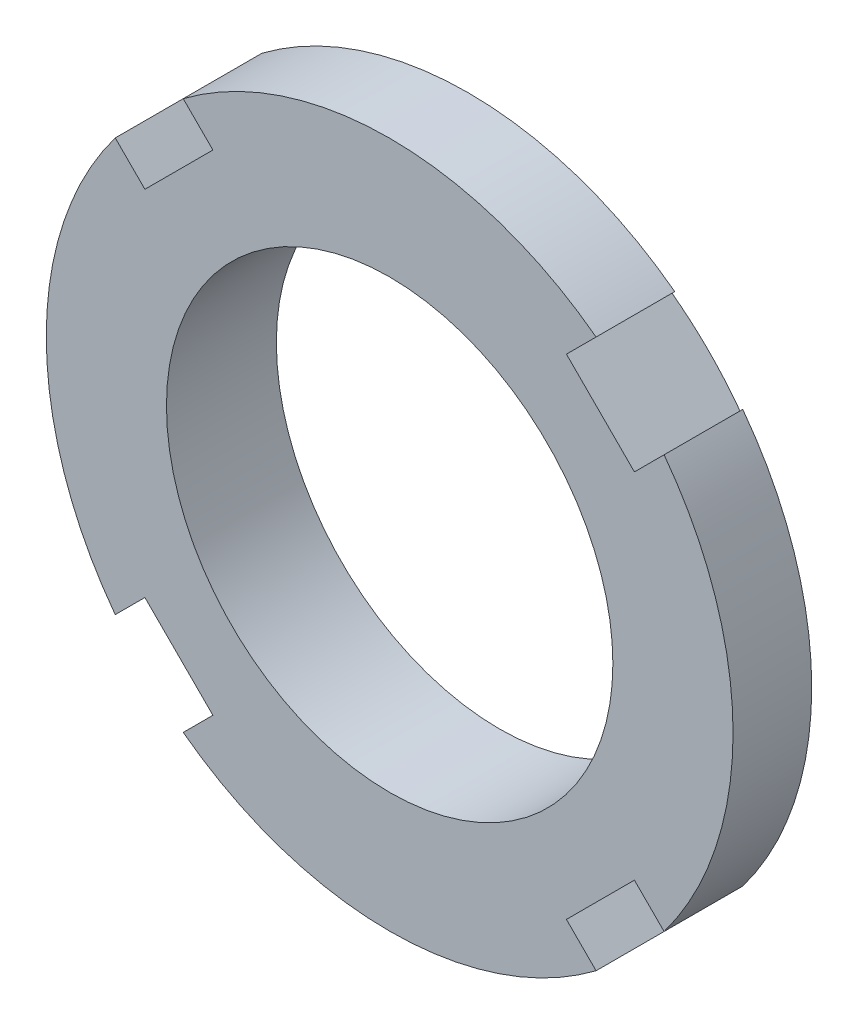
ISO-10303-21;
HEADER;
FILE_DESCRIPTION(('STEP AP214'),'2;1');
FILE_NAME('part.step','',(''),(''),'','','');
FILE_SCHEMA(('AUTOMOTIVE_DESIGN { 1 0 10303 214 1 1 1 1 }'));
ENDSEC;
DATA;
#1=APPLICATION_CONTEXT('core data for automotive mechanical design processes');
#2=APPLICATION_PROTOCOL_DEFINITION('international standard','automotive_design',2000,#1);
#3=PRODUCT_CONTEXT('',#1,'mechanical');
#4=PRODUCT('Part','Part','',(#3));
#5=PRODUCT_RELATED_PRODUCT_CATEGORY('part','',(#4));
#6=PRODUCT_DEFINITION_FORMATION('','',#4);
#7=PRODUCT_DEFINITION_CONTEXT('part definition',#1,'design');
#8=PRODUCT_DEFINITION('design','',#6,#7);
#9=PRODUCT_DEFINITION_SHAPE('','',#8);
#10=(LENGTH_UNIT() NAMED_UNIT(*) SI_UNIT(.MILLI.,.METRE.));
#11=(NAMED_UNIT(*) PLANE_ANGLE_UNIT() SI_UNIT($,.RADIAN.));
#12=(NAMED_UNIT(*) SI_UNIT($,.STERADIAN.) SOLID_ANGLE_UNIT());
#13=UNCERTAINTY_MEASURE_WITH_UNIT(LENGTH_MEASURE(1.E-05),#10,'distance_accuracy_value','');
#14=(GEOMETRIC_REPRESENTATION_CONTEXT(3) GLOBAL_UNCERTAINTY_ASSIGNED_CONTEXT((#13)) GLOBAL_UNIT_ASSIGNED_CONTEXT((#10,
#11,#12)) REPRESENTATION_CONTEXT('',''));
#15=CARTESIAN_POINT('',(0.,0.,0.));
#16=DIRECTION('',(0.,0.,1.));
#17=DIRECTION('',(1.,0.,0.));
#18=AXIS2_PLACEMENT_3D('',#15,#16,#17);
#19=CARTESIAN_POINT('',(0.,0.,8.));
#20=DIRECTION('',(0.,0.,-1.));
#21=DIRECTION('',(-1.,0.,0.));
#22=AXIS2_PLACEMENT_3D('',#19,#20,#21);
#23=CYLINDRICAL_SURFACE('',#22,25.);
#24=DIRECTION('',(0.,0.,1.));
#25=VECTOR('',#24,1.);
#26=CARTESIAN_POINT('',(-19.9784447983671,15.0286973300616,0.));
#27=LINE('',#26,#25);
#28=CARTESIAN_POINT('',(-19.9784447983671,15.0286973300616,2.27292657619126));
#29=VERTEX_POINT('',#28);
#30=CARTESIAN_POINT('',(-19.9784447983671,15.0286973300616,8.));
#31=VERTEX_POINT('',#30);
#32=EDGE_CURVE('E255',#29,#31,#27,.T.);
#33=ORIENTED_EDGE('',*,*,#32,.F.);
#34=CARTESIAN_POINT('',(0.,0.,2.27292657619126));
#35=DIRECTION('',(0.,0.,1.));
#36=DIRECTION('',(1.,0.,0.));
#37=AXIS2_PLACEMENT_3D('',#34,#35,#36);
#38=CIRCLE('',#37,25.);
#39=CARTESIAN_POINT('',(-19.9784447983673,-15.0286973300613,2.27292657619126));
#40=VERTEX_POINT('',#39);
#41=EDGE_CURVE('E250',#29,#40,#38,.T.);
#42=ORIENTED_EDGE('',*,*,#41,.T.);
#43=DIRECTION('',(0.,0.,1.));
#44=VECTOR('',#43,1.);
#45=CARTESIAN_POINT('',(-19.9784447983673,-15.0286973300613,0.));
#46=LINE('',#45,#44);
#47=CARTESIAN_POINT('',(-19.9784447983673,-15.0286973300613,8.));
#48=VERTEX_POINT('',#47);
#49=EDGE_CURVE('E275',#40,#48,#46,.T.);
#50=ORIENTED_EDGE('',*,*,#49,.T.);
#51=CARTESIAN_POINT('',(0.,0.,8.));
#52=DIRECTION('',(0.,0.,1.));
#53=DIRECTION('',(1.,0.,0.));
#54=AXIS2_PLACEMENT_3D('',#51,#52,#53);
#55=CIRCLE('',#54,25.);
#56=EDGE_CURVE('E192',#31,#48,#55,.T.);
#57=ORIENTED_EDGE('',*,*,#56,.F.);
#58=EDGE_LOOP('',(#33,#42,#50,#57));
#59=FACE_BOUND('',#58,.T.);
#60=ADVANCED_FACE('F33',(#59),#23,.T.);
#61=DIRECTION('',(0.,0.,1.));
#62=VECTOR('',#61,1.);
#63=CARTESIAN_POINT('',(-15.0286973300615,-19.9784447983671,0.));
#64=LINE('',#63,#62);
#65=CARTESIAN_POINT('',(-15.0286973300615,-19.9784447983671,2.27292657619126));
#66=VERTEX_POINT('',#65);
#67=CARTESIAN_POINT('',(-15.0286973300615,-19.9784447983671,8.));
#68=VERTEX_POINT('',#67);
#69=EDGE_CURVE('E273',#66,#68,#64,.T.);
#70=ORIENTED_EDGE('',*,*,#69,.F.);
#71=CARTESIAN_POINT('',(15.0286973300614,-19.9784447983672,2.27292657619126));
#72=VERTEX_POINT('',#71);
#73=EDGE_CURVE('E169',#66,#72,#38,.T.);
#74=ORIENTED_EDGE('',*,*,#73,.T.);
#75=DIRECTION('',(0.,0.,1.));
#76=VECTOR('',#75,1.);
#77=CARTESIAN_POINT('',(15.0286973300614,-19.9784447983672,0.));
#78=LINE('',#77,#76);
#79=CARTESIAN_POINT('',(15.0286973300614,-19.9784447983672,8.));
#80=VERTEX_POINT('',#79);
#81=EDGE_CURVE('E218',#72,#80,#78,.T.);
#82=ORIENTED_EDGE('',*,*,#81,.T.);
#83=EDGE_CURVE('E197',#68,#80,#55,.T.);
#84=ORIENTED_EDGE('',*,*,#83,.F.);
#85=EDGE_LOOP('',(#70,#74,#82,#84));
#86=FACE_BOUND('',#85,.T.);
#87=ADVANCED_FACE('F394',(#86),#23,.T.);
#88=DIRECTION('',(0.,0.,1.));
#89=VECTOR('',#88,1.);
#90=CARTESIAN_POINT('',(19.9784447983672,-15.0286973300614,0.));
#91=LINE('',#90,#89);
#92=CARTESIAN_POINT('',(19.9784447983672,-15.0286973300614,2.27292657619126));
#93=VERTEX_POINT('',#92);
#94=CARTESIAN_POINT('',(19.9784447983672,-15.0286973300614,8.));
#95=VERTEX_POINT('',#94);
#96=EDGE_CURVE('E168',#93,#95,#91,.T.);
#97=ORIENTED_EDGE('',*,*,#96,.F.);
#98=CARTESIAN_POINT('',(19.9784447983672,15.0286973300614,2.27292657619126));
#99=VERTEX_POINT('',#98);
#100=EDGE_CURVE('E153',#93,#99,#38,.T.);
#101=ORIENTED_EDGE('',*,*,#100,.T.);
#102=DIRECTION('',(0.,0.,1.));
#103=VECTOR('',#102,1.);
#104=CARTESIAN_POINT('',(19.9784447983672,15.0286973300614,0.));
#105=LINE('',#104,#103);
#106=CARTESIAN_POINT('',(19.9784447983672,15.0286973300614,8.));
#107=VERTEX_POINT('',#106);
#108=EDGE_CURVE('E166',#99,#107,#105,.T.);
#109=ORIENTED_EDGE('',*,*,#108,.T.);
#110=EDGE_CURVE('E188',#95,#107,#55,.T.);
#111=ORIENTED_EDGE('',*,*,#110,.F.);
#112=EDGE_LOOP('',(#97,#101,#109,#111));
#113=FACE_BOUND('',#112,.T.);
#114=ADVANCED_FACE('F164',(#113),#23,.T.);
#115=CARTESIAN_POINT('',(0.,0.,8.));
#116=DIRECTION('',(0.,0.,1.));
#117=DIRECTION('',(1.,0.,0.));
#118=AXIS2_PLACEMENT_3D('',#115,#116,#117);
#119=PLANE('',#118);
#120=DIRECTION('',(0.707106781186541,-0.707106781186554,0.));
#121=VECTOR('',#120,1.);
#122=CARTESIAN_POINT('',(-19.9784447983671,15.0286973300616,8.));
#123=LINE('',#122,#121);
#124=CARTESIAN_POINT('',(-17.8190908859009,12.8693434175953,8.));
#125=VERTEX_POINT('',#124);
#126=EDGE_CURVE('E260',#31,#125,#123,.T.);
#127=ORIENTED_EDGE('',*,*,#126,.F.);
#128=ORIENTED_EDGE('',*,*,#56,.T.);
#129=DIRECTION('',(-0.707106781186552,-0.707106781186543,0.));
#130=VECTOR('',#129,1.);
#131=CARTESIAN_POINT('',(-19.9784447983673,-15.0286973300613,8.));
#132=LINE('',#131,#130);
#133=CARTESIAN_POINT('',(-17.8190908859011,-12.8693434175951,8.));
#134=VERTEX_POINT('',#133);
#135=EDGE_CURVE('E267',#134,#48,#132,.T.);
#136=ORIENTED_EDGE('',*,*,#135,.F.);
#137=DIRECTION('',(-0.707106781186544,0.707106781186551,0.));
#138=VECTOR('',#137,1.);
#139=CARTESIAN_POINT('',(-12.8693434175953,-17.8190908859009,8.));
#140=LINE('',#139,#138);
#141=CARTESIAN_POINT('',(-12.8693434175953,-17.8190908859009,8.));
#142=VERTEX_POINT('',#141);
#143=EDGE_CURVE('E264',#142,#134,#140,.T.);
#144=ORIENTED_EDGE('',*,*,#143,.F.);
#145=DIRECTION('',(0.707106781186551,0.707106781186543,0.));
#146=VECTOR('',#145,1.);
#147=CARTESIAN_POINT('',(-15.0286973300615,-19.9784447983671,8.));
#148=LINE('',#147,#146);
#149=EDGE_CURVE('E211',#68,#142,#148,.T.);
#150=ORIENTED_EDGE('',*,*,#149,.F.);
#151=ORIENTED_EDGE('',*,*,#83,.T.);
#152=DIRECTION('',(0.707106781186546,-0.707106781186549,0.));
#153=VECTOR('',#152,1.);
#154=CARTESIAN_POINT('',(15.0286973300614,-19.9784447983672,8.));
#155=LINE('',#154,#153);
#156=CARTESIAN_POINT('',(12.8693434175951,-17.819090885901,8.));
#157=VERTEX_POINT('',#156);
#158=EDGE_CURVE('E208',#157,#80,#155,.T.);
#159=ORIENTED_EDGE('',*,*,#158,.F.);
#160=DIRECTION('',(-0.707106781186549,-0.707106781186546,0.));
#161=VECTOR('',#160,1.);
#162=CARTESIAN_POINT('',(17.819090885901,-12.8693434175952,8.));
#163=LINE('',#162,#161);
#164=CARTESIAN_POINT('',(17.819090885901,-12.8693434175952,8.));
#165=VERTEX_POINT('',#164);
#166=EDGE_CURVE('E223',#165,#157,#163,.T.);
#167=ORIENTED_EDGE('',*,*,#166,.F.);
#168=DIRECTION('',(-0.707106781186546,0.707106781186549,0.));
#169=VECTOR('',#168,1.);
#170=CARTESIAN_POINT('',(19.9784447983672,-15.0286973300614,8.));
#171=LINE('',#170,#169);
#172=EDGE_CURVE('E222',#95,#165,#171,.T.);
#173=ORIENTED_EDGE('',*,*,#172,.F.);
#174=ORIENTED_EDGE('',*,*,#110,.T.);
#175=DIRECTION('',(0.707106781186547,0.707106781186548,0.));
#176=VECTOR('',#175,1.);
#177=CARTESIAN_POINT('',(19.9784447983672,15.0286973300614,8.));
#178=LINE('',#177,#176);
#179=CARTESIAN_POINT('',(17.819090885901,12.8693434175952,8.));
#180=VERTEX_POINT('',#179);
#181=EDGE_CURVE('E175',#180,#107,#178,.T.);
#182=ORIENTED_EDGE('',*,*,#181,.F.);
#183=DIRECTION('',(0.707106781186549,-0.707106781186546,0.));
#184=VECTOR('',#183,1.);
#185=CARTESIAN_POINT('',(12.8693434175951,17.819090885901,8.));
#186=LINE('',#185,#184);
#187=CARTESIAN_POINT('',(12.8693434175951,17.819090885901,8.));
#188=VERTEX_POINT('',#187);
#189=EDGE_CURVE('E233',#188,#180,#186,.T.);
#190=ORIENTED_EDGE('',*,*,#189,.F.);
#191=DIRECTION('',(-0.707106781186547,-0.707106781186548,0.));
#192=VECTOR('',#191,1.);
#193=CARTESIAN_POINT('',(15.0286973300613,19.9784447983672,8.));
#194=LINE('',#193,#192);
#195=CARTESIAN_POINT('',(15.0286973300613,19.9784447983672,8.));
#196=VERTEX_POINT('',#195);
#197=EDGE_CURVE('E181',#196,#188,#194,.T.);
#198=ORIENTED_EDGE('',*,*,#197,.F.);
#199=CARTESIAN_POINT('',(-15.0286973300612,19.9784447983673,8.));
#200=VERTEX_POINT('',#199);
#201=EDGE_CURVE('E46',#196,#200,#55,.T.);
#202=ORIENTED_EDGE('',*,*,#201,.T.);
#203=DIRECTION('',(-0.707106781186541,0.707106781186554,0.));
#204=VECTOR('',#203,1.);
#205=CARTESIAN_POINT('',(-15.0286973300612,19.9784447983673,8.));
#206=LINE('',#205,#204);
#207=CARTESIAN_POINT('',(-12.869343417595,17.8190908859011,8.));
#208=VERTEX_POINT('',#207);
#209=EDGE_CURVE('E254',#208,#200,#206,.T.);
#210=ORIENTED_EDGE('',*,*,#209,.F.);
#211=DIRECTION('',(0.707106781186554,0.707106781186541,0.));
#212=VECTOR('',#211,1.);
#213=CARTESIAN_POINT('',(-17.8190908859009,12.8693434175953,8.));
#214=LINE('',#213,#212);
#215=EDGE_CURVE('E408',#125,#208,#214,.T.);
#216=ORIENTED_EDGE('',*,*,#215,.F.);
#217=EDGE_LOOP('',(#127,#128,#136,#144,#150,#151,#159,#167,#173,#174,#182,#190,#198,#202,#210,#216));
#218=FACE_BOUND('',#217,.T.);
#219=CARTESIAN_POINT('',(0.,0.,8.));
#220=DIRECTION('',(0.,0.,1.));
#221=DIRECTION('',(1.,0.,0.));
#222=AXIS2_PLACEMENT_3D('',#219,#220,#221);
#223=CIRCLE('',#222,16.25);
#224=CARTESIAN_POINT('',(16.25,0.,8.));
#225=VERTEX_POINT('',#224);
#226=EDGE_CURVE('E185',#225,#225,#223,.T.);
#227=ORIENTED_EDGE('',*,*,#226,.F.);
#228=EDGE_LOOP('',(#227));
#229=FACE_BOUND('',#228,.T.);
#230=ADVANCED_FACE('F205',(#218,#229),#119,.T.);
#231=CARTESIAN_POINT('',(0.,0.,0.));
#232=DIRECTION('',(0.,0.,1.));
#233=DIRECTION('',(1.,0.,0.));
#234=AXIS2_PLACEMENT_3D('',#231,#232,#233);
#235=PLANE('',#234);
#236=CARTESIAN_POINT('',(0.,0.,0.));
#237=DIRECTION('',(0.,0.,1.));
#238=DIRECTION('',(1.,0.,0.));
#239=AXIS2_PLACEMENT_3D('',#236,#237,#238);
#240=CIRCLE('',#239,21.5);
#241=CARTESIAN_POINT('',(21.5,0.,0.));
#242=VERTEX_POINT('',#241);
#243=EDGE_CURVE('E249',#242,#242,#240,.T.);
#244=ORIENTED_EDGE('',*,*,#243,.F.);
#245=EDGE_LOOP('',(#244));
#246=FACE_BOUND('',#245,.T.);
#247=CARTESIAN_POINT('',(0.,0.,0.));
#248=DIRECTION('',(0.,0.,1.));
#249=DIRECTION('',(1.,0.,0.));
#250=AXIS2_PLACEMENT_3D('',#247,#248,#249);
#251=CIRCLE('',#250,16.25);
#252=CARTESIAN_POINT('',(16.25,0.,0.));
#253=VERTEX_POINT('',#252);
#254=EDGE_CURVE('E189',#253,#253,#251,.T.);
#255=ORIENTED_EDGE('',*,*,#254,.T.);
#256=EDGE_LOOP('',(#255));
#257=FACE_BOUND('',#256,.T.);
#258=ADVANCED_FACE('F385',(#246,#257),#235,.F.);
#259=DIRECTION('',(0.,0.,1.));
#260=VECTOR('',#259,1.);
#261=CARTESIAN_POINT('',(15.0286973300613,19.9784447983672,0.));
#262=LINE('',#261,#260);
#263=CARTESIAN_POINT('',(15.0286973300613,19.9784447983672,2.27292657619126));
#264=VERTEX_POINT('',#263);
#265=EDGE_CURVE('E176',#264,#196,#262,.T.);
#266=ORIENTED_EDGE('',*,*,#265,.F.);
#267=CARTESIAN_POINT('',(-15.0286973300612,19.9784447983673,2.27292657619126));
#268=VERTEX_POINT('',#267);
#269=EDGE_CURVE('E171',#264,#268,#38,.T.);
#270=ORIENTED_EDGE('',*,*,#269,.T.);
#271=DIRECTION('',(0.,0.,1.));
#272=VECTOR('',#271,1.);
#273=CARTESIAN_POINT('',(-15.0286973300612,19.9784447983673,0.));
#274=LINE('',#273,#272);
#275=EDGE_CURVE('E60',#268,#200,#274,.T.);
#276=ORIENTED_EDGE('',*,*,#275,.T.);
#277=ORIENTED_EDGE('',*,*,#201,.F.);
#278=EDGE_LOOP('',(#266,#270,#276,#277));
#279=FACE_BOUND('',#278,.T.);
#280=ADVANCED_FACE('F35',(#279),#23,.T.);
#281=CARTESIAN_POINT('',(0.,0.,8.));
#282=DIRECTION('',(0.,0.,-1.));
#283=DIRECTION('',(-1.,0.,0.));
#284=AXIS2_PLACEMENT_3D('',#281,#282,#283);
#285=CYLINDRICAL_SURFACE('',#284,16.25);
#286=ORIENTED_EDGE('',*,*,#226,.T.);
#287=EDGE_LOOP('',(#286));
#288=FACE_BOUND('',#287,.T.);
#289=ORIENTED_EDGE('',*,*,#254,.F.);
#290=EDGE_LOOP('',(#289));
#291=FACE_BOUND('',#290,.T.);
#292=ADVANCED_FACE('F379',(#288,#291),#285,.F.);
#293=CARTESIAN_POINT('',(12.8693434175951,17.819090885901,0.));
#294=DIRECTION('',(-0.707106781186546,-0.707106781186549,0.));
#295=DIRECTION('',(0.707106781186549,-0.707106781186546,0.));
#296=AXIS2_PLACEMENT_3D('',#293,#294,#295);
#297=PLANE('',#296);
#298=DIRECTION('',(0.,0.,1.));
#299=VECTOR('',#298,1.);
#300=CARTESIAN_POINT('',(17.819090885901,12.8693434175952,0.));
#301=LINE('',#300,#299);
#302=CARTESIAN_POINT('',(17.819090885901,12.8693434175952,0.312005186584959));
#303=VERTEX_POINT('',#302);
#304=EDGE_CURVE('E177',#303,#180,#301,.T.);
#305=ORIENTED_EDGE('',*,*,#304,.F.);
#306=CARTESIAN_POINT('',(17.819290885901,12.8691434175952,0.312034435583815));
#307=CARTESIAN_POINT('',(17.6134818433024,13.0749524601937,0.281928986409101));
#308=CARTESIAN_POINT('',(17.4074131788114,13.2810211246848,0.255457110846771));
#309=CARTESIAN_POINT('',(16.9948615277431,13.6935727757531,0.20993886406662));
#310=CARTESIAN_POINT('',(16.7883785310663,13.9000557724299,0.190892676118471));
#311=CARTESIAN_POINT('',(16.1696330827619,14.5188012207343,0.145217225614693));
#312=CARTESIAN_POINT('',(15.756925117255,14.9315091862412,0.129881518639502));
#313=CARTESIAN_POINT('',(14.9315091862411,15.756925117255,0.129881518639503));
#314=CARTESIAN_POINT('',(14.5188012207342,16.1696330827619,0.145217225614694));
#315=CARTESIAN_POINT('',(13.9000557724298,16.7883785310663,0.190892676118471));
#316=CARTESIAN_POINT('',(13.693572775753,16.9948615277431,0.209938864066621));
#317=CARTESIAN_POINT('',(13.2810211246847,17.4074131788114,0.255457110846772));
#318=CARTESIAN_POINT('',(13.0749524601937,17.6134818433025,0.281928986409102));
#319=CARTESIAN_POINT('',(12.8691434175951,17.819290885901,0.312034435583817));
#320=B_SPLINE_CURVE_WITH_KNOTS('',3,(#306,#307,#308,#309,#310,#311,#312,#313,#314,#315,#316,
#317,#318,#319),.UNSPECIFIED.,.F.,.F.,(4,2,2,2,2,2,4),(0.,0.877790130779212,1.75560192448506,
3.50632996192132,5.25705799935757,6.13486979306342,7.01265992384264),.UNSPECIFIED.);
#321=CARTESIAN_POINT('',(12.8693434175951,17.819090885901,0.312005186584959));
#322=VERTEX_POINT('',#321);
#323=EDGE_CURVE('E156',#303,#322,#320,.T.);
#324=ORIENTED_EDGE('',*,*,#323,.T.);
#325=DIRECTION('',(0.,0.,1.));
#326=VECTOR('',#325,1.);
#327=CARTESIAN_POINT('',(12.8693434175951,17.819090885901,0.));
#328=LINE('',#327,#326);
#329=EDGE_CURVE('E179',#322,#188,#328,.T.);
#330=ORIENTED_EDGE('',*,*,#329,.T.);
#331=ORIENTED_EDGE('',*,*,#189,.T.);
#332=EDGE_LOOP('',(#305,#324,#330,#331));
#333=FACE_BOUND('',#332,.T.);
#334=ADVANCED_FACE('F243',(#333),#297,.F.);
#335=CARTESIAN_POINT('',(15.0286973300613,19.9784447983672,0.));
#336=DIRECTION('',(-0.707106781186549,0.707106781186547,0.));
#337=DIRECTION('',(-0.707106781186547,-0.707106781186549,0.));
#338=AXIS2_PLACEMENT_3D('',#335,#336,#337);
#339=PLANE('',#338);
#340=ORIENTED_EDGE('',*,*,#329,.F.);
#341=CARTESIAN_POINT('',(12.8691434175951,17.818890885901,0.311823849963328));
#342=CARTESIAN_POINT('',(13.2292564563614,18.1790039246672,0.638365339086747));
#343=CARTESIAN_POINT('',(13.5892924697343,18.5390399380402,0.965076467939791));
#344=CARTESIAN_POINT('',(14.3092104405542,19.2589579088601,1.61883800043784));
#345=CARTESIAN_POINT('',(14.6690923980033,19.6188398663092,1.945888404078));
#346=CARTESIAN_POINT('',(15.0288973300613,19.9786447983672,2.27310844744294));
#347=B_SPLINE_CURVE_WITH_KNOTS('',3,(#341,#342,#343,#344,#345,#346),.UNSPECIFIED.,.F.,.F.,(4,2,
4),(0.,1.81491823840827,3.62983645090266),.UNSPECIFIED.);
#348=EDGE_CURVE('E370',#322,#264,#347,.T.);
#349=ORIENTED_EDGE('',*,*,#348,.T.);
#350=ORIENTED_EDGE('',*,*,#265,.T.);
#351=ORIENTED_EDGE('',*,*,#197,.T.);
#352=EDGE_LOOP('',(#340,#349,#350,#351));
#353=FACE_BOUND('',#352,.T.);
#354=ADVANCED_FACE('F247',(#353),#339,.F.);
#355=CARTESIAN_POINT('',(19.9784447983672,15.0286973300614,0.));
#356=DIRECTION('',(0.707106781186548,-0.707106781186547,0.));
#357=DIRECTION('',(0.707106781186547,0.707106781186548,0.));
#358=AXIS2_PLACEMENT_3D('',#355,#356,#357);
#359=PLANE('',#358);
#360=ORIENTED_EDGE('',*,*,#108,.F.);
#361=CARTESIAN_POINT('',(19.9786447983672,15.0288973300614,2.27310844744294));
#362=CARTESIAN_POINT('',(19.6188398663091,14.6690923980034,1.945888404078));
#363=CARTESIAN_POINT('',(19.25895790886,14.3092104405543,1.61883800043784));
#364=CARTESIAN_POINT('',(18.5390399380402,13.5892924697344,0.965076467939789));
#365=CARTESIAN_POINT('',(18.1790039246672,13.2292564563614,0.638365339086745));
#366=CARTESIAN_POINT('',(17.818890885901,12.8691434175952,0.311823849963326));
#367=B_SPLINE_CURVE_WITH_KNOTS('',3,(#361,#362,#363,#364,#365,#366),.UNSPECIFIED.,.F.,.F.,(4,2,
4),(0.,1.81491821249438,3.62983645090265),.UNSPECIFIED.);
#368=EDGE_CURVE('E150',#99,#303,#367,.T.);
#369=ORIENTED_EDGE('',*,*,#368,.T.);
#370=ORIENTED_EDGE('',*,*,#304,.T.);
#371=ORIENTED_EDGE('',*,*,#181,.T.);
#372=EDGE_LOOP('',(#360,#369,#370,#371));
#373=FACE_BOUND('',#372,.T.);
#374=ADVANCED_FACE('F173',(#373),#359,.F.);
#375=CARTESIAN_POINT('',(17.819090885901,-12.8693434175952,0.));
#376=DIRECTION('',(-0.707106781186546,0.707106781186549,0.));
#377=DIRECTION('',(-0.707106781186549,-0.707106781186546,0.));
#378=AXIS2_PLACEMENT_3D('',#375,#376,#377);
#379=PLANE('',#378);
#380=DIRECTION('',(0.,0.,1.));
#381=VECTOR('',#380,1.);
#382=CARTESIAN_POINT('',(12.8693434175951,-17.819090885901,0.));
#383=LINE('',#382,#381);
#384=CARTESIAN_POINT('',(12.8693434175951,-17.819090885901,0.312005186584959));
#385=VERTEX_POINT('',#384);
#386=EDGE_CURVE('E220',#385,#157,#383,.T.);
#387=ORIENTED_EDGE('',*,*,#386,.F.);
#388=CARTESIAN_POINT('',(12.8691434175951,-17.819290885901,0.312034435583815));
#389=CARTESIAN_POINT('',(13.0749524601937,-17.6134818433025,0.281928986409102));
#390=CARTESIAN_POINT('',(13.2810211246847,-17.4074131788114,0.255457110846771));
#391=CARTESIAN_POINT('',(13.693572775753,-16.9948615277431,0.209938864066619));
#392=CARTESIAN_POINT('',(13.9000557724298,-16.7883785310663,0.190892676118469));
#393=CARTESIAN_POINT('',(14.5188012207342,-16.1696330827619,0.145217225614691));
#394=CARTESIAN_POINT('',(14.9315091862411,-15.756925117255,0.129881518639502));
#395=CARTESIAN_POINT('',(15.756925117255,-14.9315091862412,0.129881518639504));
#396=CARTESIAN_POINT('',(16.1696330827619,-14.5188012207343,0.145217225614693));
#397=CARTESIAN_POINT('',(16.7883785310663,-13.9000557724299,0.190892676118472));
#398=CARTESIAN_POINT('',(16.9948615277431,-13.6935727757531,0.209938864066622));
#399=CARTESIAN_POINT('',(17.4074131788114,-13.2810211246848,0.255457110846773));
#400=CARTESIAN_POINT('',(17.6134818433024,-13.0749524601937,0.281928986409103));
#401=CARTESIAN_POINT('',(17.819290885901,-12.8691434175952,0.312034435583816));
#402=B_SPLINE_CURVE_WITH_KNOTS('',3,(#388,#389,#390,#391,#392,#393,#394,#395,#396,#397,#398,
#399,#400,#401),.UNSPECIFIED.,.F.,.F.,(4,2,2,2,2,2,4),(0.,0.87779013077921,1.75560192448506,
3.50632996192132,5.25705799935758,6.13486979306342,7.01265992384264),.UNSPECIFIED.);
#403=CARTESIAN_POINT('',(17.819090885901,-12.8693434175952,0.312005186584959));
#404=VERTEX_POINT('',#403);
#405=EDGE_CURVE('E350',#385,#404,#402,.T.);
#406=ORIENTED_EDGE('',*,*,#405,.T.);
#407=DIRECTION('',(0.,0.,1.));
#408=VECTOR('',#407,1.);
#409=CARTESIAN_POINT('',(17.819090885901,-12.8693434175952,0.));
#410=LINE('',#409,#408);
#411=EDGE_CURVE('E231',#404,#165,#410,.T.);
#412=ORIENTED_EDGE('',*,*,#411,.T.);
#413=ORIENTED_EDGE('',*,*,#166,.T.);
#414=EDGE_LOOP('',(#387,#406,#412,#413));
#415=FACE_BOUND('',#414,.T.);
#416=ADVANCED_FACE('F426',(#415),#379,.F.);
#417=CARTESIAN_POINT('',(19.9784447983672,-15.0286973300614,0.));
#418=DIRECTION('',(0.707106781186549,0.707106781186546,0.));
#419=DIRECTION('',(-0.707106781186546,0.707106781186549,0.));
#420=AXIS2_PLACEMENT_3D('',#417,#418,#419);
#421=PLANE('',#420);
#422=ORIENTED_EDGE('',*,*,#411,.F.);
#423=CARTESIAN_POINT('',(17.818890885901,-12.8691434175952,0.311823849963328));
#424=CARTESIAN_POINT('',(18.1790039246672,-13.2292564563614,0.638365339086746));
#425=CARTESIAN_POINT('',(18.5390399380402,-13.5892924697344,0.965076467939791));
#426=CARTESIAN_POINT('',(19.25895790886,-14.3092104405543,1.61883800043784));
#427=CARTESIAN_POINT('',(19.6188398663091,-14.6690923980034,1.945888404078));
#428=CARTESIAN_POINT('',(19.9786447983672,-15.0288973300614,2.27310844744294));
#429=B_SPLINE_CURVE_WITH_KNOTS('',3,(#423,#424,#425,#426,#427,#428),.UNSPECIFIED.,.F.,.F.,(4,2,
4),(0.,1.81491823840827,3.62983645090265),.UNSPECIFIED.);
#430=EDGE_CURVE('E160',#404,#93,#429,.T.);
#431=ORIENTED_EDGE('',*,*,#430,.T.);
#432=ORIENTED_EDGE('',*,*,#96,.T.);
#433=ORIENTED_EDGE('',*,*,#172,.T.);
#434=EDGE_LOOP('',(#422,#431,#432,#433));
#435=FACE_BOUND('',#434,.T.);
#436=ADVANCED_FACE('F423',(#435),#421,.F.);
#437=CARTESIAN_POINT('',(15.0286973300614,-19.9784447983672,0.));
#438=DIRECTION('',(-0.707106781186549,-0.707106781186546,0.));
#439=DIRECTION('',(0.707106781186546,-0.707106781186549,0.));
#440=AXIS2_PLACEMENT_3D('',#437,#438,#439);
#441=PLANE('',#440);
#442=ORIENTED_EDGE('',*,*,#81,.F.);
#443=CARTESIAN_POINT('',(15.0288973300614,-19.9786447983672,2.27310844744294));
#444=CARTESIAN_POINT('',(14.6690923980033,-19.6188398663092,1.945888404078));
#445=CARTESIAN_POINT('',(14.3092104405542,-19.2589579088601,1.61883800043784));
#446=CARTESIAN_POINT('',(13.5892924697343,-18.5390399380402,0.965076467939788));
#447=CARTESIAN_POINT('',(13.2292564563614,-18.1790039246672,0.638365339086743));
#448=CARTESIAN_POINT('',(12.8691434175951,-17.818890885901,0.311823849963325));
#449=B_SPLINE_CURVE_WITH_KNOTS('',3,(#443,#444,#445,#446,#447,#448),.UNSPECIFIED.,.F.,.F.,(4,2,
4),(0.,1.81491821249438,3.62983645090265),.UNSPECIFIED.);
#450=EDGE_CURVE('E343',#72,#385,#449,.T.);
#451=ORIENTED_EDGE('',*,*,#450,.T.);
#452=ORIENTED_EDGE('',*,*,#386,.T.);
#453=ORIENTED_EDGE('',*,*,#158,.T.);
#454=EDGE_LOOP('',(#442,#451,#452,#453));
#455=FACE_BOUND('',#454,.T.);
#456=ADVANCED_FACE('F216',(#455),#441,.F.);
#457=CARTESIAN_POINT('',(-12.8693434175953,-17.8190908859009,0.));
#458=DIRECTION('',(0.707106781186551,0.707106781186544,0.));
#459=DIRECTION('',(-0.707106781186544,0.707106781186551,0.));
#460=AXIS2_PLACEMENT_3D('',#457,#458,#459);
#461=PLANE('',#460);
#462=DIRECTION('',(0.,0.,1.));
#463=VECTOR('',#462,1.);
#464=CARTESIAN_POINT('',(-17.8190908859011,-12.8693434175951,0.));
#465=LINE('',#464,#463);
#466=CARTESIAN_POINT('',(-17.8190908859011,-12.8693434175951,0.312005186584959));
#467=VERTEX_POINT('',#466);
#468=EDGE_CURVE('E271',#467,#134,#465,.T.);
#469=ORIENTED_EDGE('',*,*,#468,.F.);
#470=CARTESIAN_POINT('',(-17.8192908859011,-12.8691434175951,0.312034435583815));
#471=CARTESIAN_POINT('',(-17.6134818433025,-13.0749524601936,0.281928986409101));
#472=CARTESIAN_POINT('',(-17.4074131788115,-13.2810211246847,0.255457110846771));
#473=CARTESIAN_POINT('',(-16.9948615277432,-13.693572775753,0.20993886406662));
#474=CARTESIAN_POINT('',(-16.7883785310664,-13.9000557724298,0.190892676118471));
#475=CARTESIAN_POINT('',(-16.169633082762,-14.5188012207342,0.145217225614694));
#476=CARTESIAN_POINT('',(-15.7569251172551,-14.9315091862411,0.129881518639504));
#477=CARTESIAN_POINT('',(-14.9315091862412,-15.7569251172549,0.129881518639502));
#478=CARTESIAN_POINT('',(-14.5188012207343,-16.1696330827618,0.145217225614691));
#479=CARTESIAN_POINT('',(-13.90005577243,-16.7883785310662,0.190892676118471));
#480=CARTESIAN_POINT('',(-13.6935727757532,-16.994861527743,0.209938864066622));
#481=CARTESIAN_POINT('',(-13.2810211246848,-17.4074131788113,0.255457110846775));
#482=CARTESIAN_POINT('',(-13.0749524601938,-17.6134818433024,0.281928986409105));
#483=CARTESIAN_POINT('',(-12.8691434175953,-17.8192908859009,0.312034435583816));
#484=B_SPLINE_CURVE_WITH_KNOTS('',3,(#470,#471,#472,#473,#474,#475,#476,#477,#478,#479,#480,
#481,#482,#483),.UNSPECIFIED.,.F.,.F.,(4,2,2,2,2,2,4),(0.,0.877790130779212,1.75560192448506,
3.50632996192132,5.25705799935758,6.13486979306343,7.01265992384264),.UNSPECIFIED.);
#485=CARTESIAN_POINT('',(-12.8693434175953,-17.8190908859009,0.312005186584959));
#486=VERTEX_POINT('',#485);
#487=EDGE_CURVE('E330',#467,#486,#484,.T.);
#488=ORIENTED_EDGE('',*,*,#487,.T.);
#489=DIRECTION('',(0.,0.,1.));
#490=VECTOR('',#489,1.);
#491=CARTESIAN_POINT('',(-12.8693434175953,-17.8190908859009,0.));
#492=LINE('',#491,#490);
#493=EDGE_CURVE('E227',#486,#142,#492,.T.);
#494=ORIENTED_EDGE('',*,*,#493,.T.);
#495=ORIENTED_EDGE('',*,*,#143,.T.);
#496=EDGE_LOOP('',(#469,#488,#494,#495));
#497=FACE_BOUND('',#496,.T.);
#498=ADVANCED_FACE('F285',(#497),#461,.F.);
#499=CARTESIAN_POINT('',(-15.0286973300615,-19.9784447983671,0.));
#500=DIRECTION('',(0.707106781186543,-0.707106781186552,0.));
#501=DIRECTION('',(0.707106781186552,0.707106781186543,0.));
#502=AXIS2_PLACEMENT_3D('',#499,#500,#501);
#503=PLANE('',#502);
#504=ORIENTED_EDGE('',*,*,#493,.F.);
#505=CARTESIAN_POINT('',(-12.8691434175953,-17.8188908859009,0.311823849963328));
#506=CARTESIAN_POINT('',(-13.2292564563615,-18.1790039246671,0.638365339086746));
#507=CARTESIAN_POINT('',(-13.5892924697345,-18.5390399380401,0.965076467939791));
#508=CARTESIAN_POINT('',(-14.3092104405543,-19.25895790886,1.61883800043784));
#509=CARTESIAN_POINT('',(-14.6690923980034,-19.6188398663091,1.945888404078));
#510=CARTESIAN_POINT('',(-15.0288973300615,-19.9786447983671,2.27310844744294));
#511=B_SPLINE_CURVE_WITH_KNOTS('',3,(#505,#506,#507,#508,#509,#510),.UNSPECIFIED.,.F.,.F.,(4,2,
4),(0.,1.81491823840827,3.62983645090265),.UNSPECIFIED.);
#512=EDGE_CURVE('E337',#486,#66,#511,.T.);
#513=ORIENTED_EDGE('',*,*,#512,.T.);
#514=ORIENTED_EDGE('',*,*,#69,.T.);
#515=ORIENTED_EDGE('',*,*,#149,.T.);
#516=EDGE_LOOP('',(#504,#513,#514,#515));
#517=FACE_BOUND('',#516,.T.);
#518=ADVANCED_FACE('F403',(#517),#503,.F.);
#519=CARTESIAN_POINT('',(-19.9784447983673,-15.0286973300613,0.));
#520=DIRECTION('',(-0.707106781186543,0.707106781186552,0.));
#521=DIRECTION('',(-0.707106781186552,-0.707106781186543,0.));
#522=AXIS2_PLACEMENT_3D('',#519,#520,#521);
#523=PLANE('',#522);
#524=ORIENTED_EDGE('',*,*,#49,.F.);
#525=CARTESIAN_POINT('',(-19.9786447983673,-15.0288973300613,2.27310844744294));
#526=CARTESIAN_POINT('',(-19.6188398663092,-14.6690923980032,1.945888404078));
#527=CARTESIAN_POINT('',(-19.2589579088601,-14.3092104405541,1.61883800043784));
#528=CARTESIAN_POINT('',(-18.5390399380403,-13.5892924697343,0.96507646793979));
#529=CARTESIAN_POINT('',(-18.1790039246673,-13.2292564563613,0.638365339086746));
#530=CARTESIAN_POINT('',(-17.8188908859011,-12.8691434175951,0.311823849963328));
#531=B_SPLINE_CURVE_WITH_KNOTS('',3,(#525,#526,#527,#528,#529,#530),.UNSPECIFIED.,.F.,.F.,(4,2,
4),(0.,1.81491821249438,3.62983645090265),.UNSPECIFIED.);
#532=EDGE_CURVE('E282',#40,#467,#531,.T.);
#533=ORIENTED_EDGE('',*,*,#532,.T.);
#534=ORIENTED_EDGE('',*,*,#468,.T.);
#535=ORIENTED_EDGE('',*,*,#135,.T.);
#536=EDGE_LOOP('',(#524,#533,#534,#535));
#537=FACE_BOUND('',#536,.T.);
#538=ADVANCED_FACE('F280',(#537),#523,.F.);
#539=CARTESIAN_POINT('',(-17.8190908859009,12.8693434175953,0.));
#540=DIRECTION('',(0.707106781186541,-0.707106781186554,0.));
#541=DIRECTION('',(0.707106781186554,0.707106781186541,0.));
#542=AXIS2_PLACEMENT_3D('',#539,#540,#541);
#543=PLANE('',#542);
#544=DIRECTION('',(0.,0.,1.));
#545=VECTOR('',#544,1.);
#546=CARTESIAN_POINT('',(-12.869343417595,17.8190908859011,0.));
#547=LINE('',#546,#545);
#548=CARTESIAN_POINT('',(-12.869343417595,17.8190908859011,0.312005186584959));
#549=VERTEX_POINT('',#548);
#550=EDGE_CURVE('E256',#549,#208,#547,.T.);
#551=ORIENTED_EDGE('',*,*,#550,.F.);
#552=CARTESIAN_POINT('',(-12.869143417595,17.8192908859011,0.312034435583815));
#553=CARTESIAN_POINT('',(-13.0749524601936,17.6134818433026,0.281928986409102));
#554=CARTESIAN_POINT('',(-13.2810211246846,17.4074131788115,0.255457110846771));
#555=CARTESIAN_POINT('',(-13.6935727757529,16.9948615277432,0.20993886406662));
#556=CARTESIAN_POINT('',(-13.9000557724297,16.7883785310664,0.19089267611847));
#557=CARTESIAN_POINT('',(-14.5188012207341,16.169633082762,0.145217225614692));
#558=CARTESIAN_POINT('',(-14.931509186241,15.7569251172551,0.129881518639503));
#559=CARTESIAN_POINT('',(-15.7569251172549,14.9315091862413,0.129881518639503));
#560=CARTESIAN_POINT('',(-16.1696330827618,14.5188012207344,0.145217225614692));
#561=CARTESIAN_POINT('',(-16.7883785310662,13.90005577243,0.19089267611847));
#562=CARTESIAN_POINT('',(-16.994861527743,13.6935727757532,0.209938864066621));
#563=CARTESIAN_POINT('',(-17.4074131788113,13.2810211246849,0.255457110846773));
#564=CARTESIAN_POINT('',(-17.6134818433023,13.0749524601939,0.281928986409104));
#565=CARTESIAN_POINT('',(-17.8192908859009,12.8691434175953,0.312034435583817));
#566=B_SPLINE_CURVE_WITH_KNOTS('',3,(#552,#553,#554,#555,#556,#557,#558,#559,#560,#561,#562,
#563,#564,#565),.UNSPECIFIED.,.F.,.F.,(4,2,2,2,2,2,4),(0.,0.87779013077921,1.75560192448506,
3.50632996192132,5.25705799935757,6.13486979306343,7.01265992384264),.UNSPECIFIED.);
#567=CARTESIAN_POINT('',(-17.8190908859009,12.8693434175953,0.312005186584959));
#568=VERTEX_POINT('',#567);
#569=EDGE_CURVE('E53',#549,#568,#566,.T.);
#570=ORIENTED_EDGE('',*,*,#569,.T.);
#571=DIRECTION('',(0.,0.,1.));
#572=VECTOR('',#571,1.);
#573=CARTESIAN_POINT('',(-17.8190908859009,12.8693434175953,0.));
#574=LINE('',#573,#572);
#575=EDGE_CURVE('E258',#568,#125,#574,.T.);
#576=ORIENTED_EDGE('',*,*,#575,.T.);
#577=ORIENTED_EDGE('',*,*,#215,.T.);
#578=EDGE_LOOP('',(#551,#570,#576,#577));
#579=FACE_BOUND('',#578,.T.);
#580=ADVANCED_FACE('F309',(#579),#543,.F.);
#581=CARTESIAN_POINT('',(-19.9784447983671,15.0286973300616,0.));
#582=DIRECTION('',(-0.707106781186554,-0.707106781186541,0.));
#583=DIRECTION('',(0.707106781186541,-0.707106781186554,0.));
#584=AXIS2_PLACEMENT_3D('',#581,#582,#583);
#585=PLANE('',#584);
#586=ORIENTED_EDGE('',*,*,#575,.F.);
#587=CARTESIAN_POINT('',(-17.8188908859009,12.8691434175953,0.311823849963328));
#588=CARTESIAN_POINT('',(-18.1790039246671,13.2292564563615,0.638365339086746));
#589=CARTESIAN_POINT('',(-18.5390399380401,13.5892924697345,0.965076467939791));
#590=CARTESIAN_POINT('',(-19.2589579088599,14.3092104405544,1.61883800043784));
#591=CARTESIAN_POINT('',(-19.618839866309,14.6690923980035,1.945888404078));
#592=CARTESIAN_POINT('',(-19.9786447983671,15.0288973300616,2.27310844744294));
#593=B_SPLINE_CURVE_WITH_KNOTS('',3,(#587,#588,#589,#590,#591,#592),.UNSPECIFIED.,.F.,.F.,(4,2,
4),(0.,1.81491823840827,3.62983645090265),.UNSPECIFIED.);
#594=EDGE_CURVE('E303',#568,#29,#593,.T.);
#595=ORIENTED_EDGE('',*,*,#594,.T.);
#596=ORIENTED_EDGE('',*,*,#32,.T.);
#597=ORIENTED_EDGE('',*,*,#126,.T.);
#598=EDGE_LOOP('',(#586,#595,#596,#597));
#599=FACE_BOUND('',#598,.T.);
#600=ADVANCED_FACE('F315',(#599),#585,.F.);
#601=CARTESIAN_POINT('',(-15.0286973300612,19.9784447983673,0.));
#602=DIRECTION('',(0.707106781186554,0.707106781186541,0.));
#603=DIRECTION('',(-0.707106781186541,0.707106781186554,0.));
#604=AXIS2_PLACEMENT_3D('',#601,#602,#603);
#605=PLANE('',#604);
#606=ORIENTED_EDGE('',*,*,#275,.F.);
#607=CARTESIAN_POINT('',(-15.0288973300612,19.9786447983673,2.27310844744294));
#608=CARTESIAN_POINT('',(-14.6690923980032,19.6188398663093,1.945888404078));
#609=CARTESIAN_POINT('',(-14.3092104405541,19.2589579088602,1.61883800043784));
#610=CARTESIAN_POINT('',(-13.5892924697342,18.5390399380403,0.965076467939788));
#611=CARTESIAN_POINT('',(-13.2292564563612,18.1790039246673,0.638365339086744));
#612=CARTESIAN_POINT('',(-12.869143417595,17.8188908859011,0.311823849963325));
#613=B_SPLINE_CURVE_WITH_KNOTS('',3,(#607,#608,#609,#610,#611,#612),.UNSPECIFIED.,.F.,.F.,(4,2,
4),(0.,1.81491821249438,3.62983645090265),.UNSPECIFIED.);
#614=EDGE_CURVE('E11',#268,#549,#613,.T.);
#615=ORIENTED_EDGE('',*,*,#614,.T.);
#616=ORIENTED_EDGE('',*,*,#550,.T.);
#617=ORIENTED_EDGE('',*,*,#209,.T.);
#618=EDGE_LOOP('',(#606,#615,#616,#617));
#619=FACE_BOUND('',#618,.T.);
#620=ADVANCED_FACE('F252',(#619),#605,.F.);
#621=CARTESIAN_POINT('',(0.,0.,0.));
#622=DIRECTION('',(0.,0.,1.));
#623=DIRECTION('',(1.,0.,0.));
#624=AXIS2_PLACEMENT_3D('',#621,#622,#623);
#625=CONICAL_SURFACE('',#624,21.5,0.994837673636774);
#626=ORIENTED_EDGE('',*,*,#243,.T.);
#627=EDGE_LOOP('',(#626));
#628=FACE_BOUND('',#627,.T.);
#629=ORIENTED_EDGE('',*,*,#323,.F.);
#630=ORIENTED_EDGE('',*,*,#368,.F.);
#631=ORIENTED_EDGE('',*,*,#100,.F.);
#632=ORIENTED_EDGE('',*,*,#430,.F.);
#633=ORIENTED_EDGE('',*,*,#405,.F.);
#634=ORIENTED_EDGE('',*,*,#450,.F.);
#635=ORIENTED_EDGE('',*,*,#73,.F.);
#636=ORIENTED_EDGE('',*,*,#512,.F.);
#637=ORIENTED_EDGE('',*,*,#487,.F.);
#638=ORIENTED_EDGE('',*,*,#532,.F.);
#639=ORIENTED_EDGE('',*,*,#41,.F.);
#640=ORIENTED_EDGE('',*,*,#594,.F.);
#641=ORIENTED_EDGE('',*,*,#569,.F.);
#642=ORIENTED_EDGE('',*,*,#614,.F.);
#643=ORIENTED_EDGE('',*,*,#269,.F.);
#644=ORIENTED_EDGE('',*,*,#348,.F.);
#645=EDGE_LOOP('',(#629,#630,#631,#632,#633,#634,#635,#636,#637,#638,#639,#640,#641,#642,#643,#644));
#646=FACE_BOUND('',#645,.T.);
#647=ADVANCED_FACE('F152',(#628,#646),#625,.T.);
#648=CLOSED_SHELL('',(#60,#87,#114,#230,#258,#280,#292,#334,#354,#374,#416,#436,#456,#498,#518,
#538,#580,#600,#620,#647));
#649=MANIFOLD_SOLID_BREP('B2',#648);
#650=ADVANCED_BREP_SHAPE_REPRESENTATION('',(#18,#649),#14);
#651=SHAPE_DEFINITION_REPRESENTATION(#9,#650);
ENDSEC;
END-ISO-10303-21;
